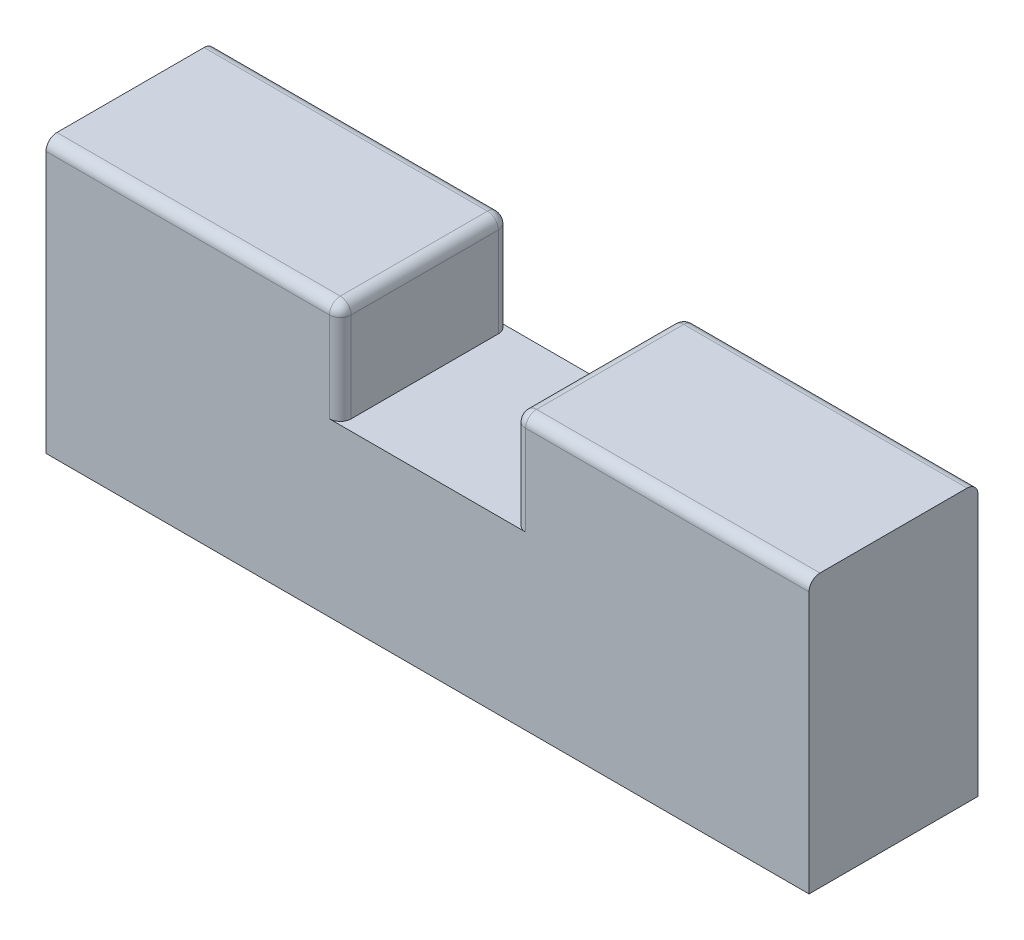
ISO-10303-21;
HEADER;
FILE_DESCRIPTION(('STEP AP214'),'2;1');
FILE_NAME('part.step','',(''),(''),'','','');
FILE_SCHEMA(('AUTOMOTIVE_DESIGN { 1 0 10303 214 1 1 1 1 }'));
ENDSEC;
DATA;
#1=APPLICATION_CONTEXT('core data for automotive mechanical design processes');
#2=APPLICATION_PROTOCOL_DEFINITION('international standard','automotive_design',2000,#1);
#3=PRODUCT_CONTEXT('',#1,'mechanical');
#4=PRODUCT('Part','Part','',(#3));
#5=PRODUCT_RELATED_PRODUCT_CATEGORY('part','',(#4));
#6=PRODUCT_DEFINITION_FORMATION('','',#4);
#7=PRODUCT_DEFINITION_CONTEXT('part definition',#1,'design');
#8=PRODUCT_DEFINITION('design','',#6,#7);
#9=PRODUCT_DEFINITION_SHAPE('','',#8);
#10=(LENGTH_UNIT() NAMED_UNIT(*) SI_UNIT(.MILLI.,.METRE.));
#11=(NAMED_UNIT(*) PLANE_ANGLE_UNIT() SI_UNIT($,.RADIAN.));
#12=(NAMED_UNIT(*) SI_UNIT($,.STERADIAN.) SOLID_ANGLE_UNIT());
#13=UNCERTAINTY_MEASURE_WITH_UNIT(LENGTH_MEASURE(1.E-05),#10,'distance_accuracy_value','');
#14=(GEOMETRIC_REPRESENTATION_CONTEXT(3) GLOBAL_UNCERTAINTY_ASSIGNED_CONTEXT((#13)) GLOBAL_UNIT_ASSIGNED_CONTEXT((#10,
#11,#12)) REPRESENTATION_CONTEXT('',''));
#15=CARTESIAN_POINT('',(0.,0.,0.));
#16=DIRECTION('',(0.,0.,1.));
#17=DIRECTION('',(1.,0.,0.));
#18=AXIS2_PLACEMENT_3D('',#15,#16,#17);
#19=CARTESIAN_POINT('',(35.,12.5,7.75));
#20=DIRECTION('',(0.,-1.,0.));
#21=DIRECTION('',(0.,0.,-1.));
#22=AXIS2_PLACEMENT_3D('',#19,#20,#21);
#23=PLANE('',#22);
#24=DIRECTION('',(0.,0.,1.));
#25=VECTOR('',#24,1.);
#26=CARTESIAN_POINT('',(9.,12.5,7.75));
#27=LINE('',#26,#25);
#28=CARTESIAN_POINT('',(9.,12.5,-6.75));
#29=VERTEX_POINT('',#28);
#30=CARTESIAN_POINT('',(9.,12.5,6.75));
#31=VERTEX_POINT('',#30);
#32=EDGE_CURVE('E189',#29,#31,#27,.T.);
#33=ORIENTED_EDGE('',*,*,#32,.T.);
#34=DIRECTION('',(-1.,0.,0.));
#35=VECTOR('',#34,1.);
#36=CARTESIAN_POINT('',(35.,12.5,6.75));
#37=LINE('',#36,#35);
#38=CARTESIAN_POINT('',(35.,12.5,6.75));
#39=VERTEX_POINT('',#38);
#40=EDGE_CURVE('E285',#31,#39,#37,.F.);
#41=ORIENTED_EDGE('',*,*,#40,.T.);
#42=DIRECTION('',(0.,0.,1.));
#43=VECTOR('',#42,1.);
#44=CARTESIAN_POINT('',(35.,12.5,7.75));
#45=LINE('',#44,#43);
#46=CARTESIAN_POINT('',(35.,12.5,-6.75));
#47=VERTEX_POINT('',#46);
#48=EDGE_CURVE('E179',#47,#39,#45,.T.);
#49=ORIENTED_EDGE('',*,*,#48,.F.);
#50=DIRECTION('',(-1.,0.,0.));
#51=VECTOR('',#50,1.);
#52=CARTESIAN_POINT('',(35.,12.5,-6.75));
#53=LINE('',#52,#51);
#54=EDGE_CURVE('E282',#47,#29,#53,.T.);
#55=ORIENTED_EDGE('',*,*,#54,.T.);
#56=EDGE_LOOP('',(#33,#41,#49,#55));
#57=FACE_BOUND('',#56,.T.);
#58=ADVANCED_FACE('F49',(#57),#23,.F.);
#59=CARTESIAN_POINT('',(35.,-12.5,-7.75));
#60=DIRECTION('',(0.,0.,1.));
#61=DIRECTION('',(1.,0.,0.));
#62=AXIS2_PLACEMENT_3D('',#59,#60,#61);
#63=PLANE('',#62);
#64=DIRECTION('',(1.,0.,0.));
#65=VECTOR('',#64,1.);
#66=CARTESIAN_POINT('',(-8.,3.25000000000001,-7.75));
#67=LINE('',#66,#65);
#68=CARTESIAN_POINT('',(-9.00000000000001,3.25000000000001,-7.75));
#69=VERTEX_POINT('',#68);
#70=CARTESIAN_POINT('',(9.,3.25000000000001,-7.75));
#71=VERTEX_POINT('',#70);
#72=EDGE_CURVE('E362',#69,#71,#67,.T.);
#73=ORIENTED_EDGE('',*,*,#72,.T.);
#74=DIRECTION('',(0.,1.,0.));
#75=VECTOR('',#74,1.);
#76=CARTESIAN_POINT('',(9.,-12.5,-7.75));
#77=LINE('',#76,#75);
#78=CARTESIAN_POINT('',(9.,11.5,-7.75));
#79=VERTEX_POINT('',#78);
#80=EDGE_CURVE('E266',#71,#79,#77,.T.);
#81=ORIENTED_EDGE('',*,*,#80,.T.);
#82=DIRECTION('',(-1.,0.,0.));
#83=VECTOR('',#82,1.);
#84=CARTESIAN_POINT('',(35.,11.5,-7.75));
#85=LINE('',#84,#83);
#86=CARTESIAN_POINT('',(35.,11.5,-7.75));
#87=VERTEX_POINT('',#86);
#88=EDGE_CURVE('E263',#79,#87,#85,.F.);
#89=ORIENTED_EDGE('',*,*,#88,.T.);
#90=DIRECTION('',(0.,1.,0.));
#91=VECTOR('',#90,1.);
#92=CARTESIAN_POINT('',(35.,-12.5,-7.75));
#93=LINE('',#92,#91);
#94=CARTESIAN_POINT('',(35.,-12.5,-7.75));
#95=VERTEX_POINT('',#94);
#96=EDGE_CURVE('E214',#95,#87,#93,.T.);
#97=ORIENTED_EDGE('',*,*,#96,.F.);
#98=DIRECTION('',(-1.,0.,0.));
#99=VECTOR('',#98,1.);
#100=CARTESIAN_POINT('',(35.,-12.5,-7.75));
#101=LINE('',#100,#99);
#102=CARTESIAN_POINT('',(-35.,-12.5,-7.75));
#103=VERTEX_POINT('',#102);
#104=EDGE_CURVE('E190',#95,#103,#101,.T.);
#105=ORIENTED_EDGE('',*,*,#104,.T.);
#106=DIRECTION('',(0.,1.,0.));
#107=VECTOR('',#106,1.);
#108=CARTESIAN_POINT('',(-35.,-12.5,-7.75));
#109=LINE('',#108,#107);
#110=CARTESIAN_POINT('',(-35.,11.5,-7.75));
#111=VERTEX_POINT('',#110);
#112=EDGE_CURVE('E202',#103,#111,#109,.T.);
#113=ORIENTED_EDGE('',*,*,#112,.T.);
#114=DIRECTION('',(-1.,0.,0.));
#115=VECTOR('',#114,1.);
#116=CARTESIAN_POINT('',(35.,11.5,-7.75));
#117=LINE('',#116,#115);
#118=CARTESIAN_POINT('',(-9.00000000000001,11.5,-7.75));
#119=VERTEX_POINT('',#118);
#120=EDGE_CURVE('E256',#111,#119,#117,.F.);
#121=ORIENTED_EDGE('',*,*,#120,.T.);
#122=DIRECTION('',(0.,-1.,0.));
#123=VECTOR('',#122,1.);
#124=CARTESIAN_POINT('',(-9.00000000000001,-12.5,-7.75));
#125=LINE('',#124,#123);
#126=EDGE_CURVE('E259',#119,#69,#125,.T.);
#127=ORIENTED_EDGE('',*,*,#126,.T.);
#128=EDGE_LOOP('',(#73,#81,#89,#97,#105,#113,#121,#127));
#129=FACE_BOUND('',#128,.T.);
#130=ADVANCED_FACE('F407',(#129),#63,.F.);
#131=DIRECTION('',(0.,0.,-1.));
#132=VECTOR('',#131,1.);
#133=CARTESIAN_POINT('',(-9.00000000000001,12.5,7.75));
#134=LINE('',#133,#132);
#135=CARTESIAN_POINT('',(-9.00000000000001,12.5,6.75));
#136=VERTEX_POINT('',#135);
#137=CARTESIAN_POINT('',(-9.00000000000001,12.5,-6.75));
#138=VERTEX_POINT('',#137);
#139=EDGE_CURVE('E223',#136,#138,#134,.T.);
#140=ORIENTED_EDGE('',*,*,#139,.T.);
#141=DIRECTION('',(-1.,0.,0.));
#142=VECTOR('',#141,1.);
#143=CARTESIAN_POINT('',(35.,12.5,-6.75));
#144=LINE('',#143,#142);
#145=CARTESIAN_POINT('',(-35.,12.5,-6.75));
#146=VERTEX_POINT('',#145);
#147=EDGE_CURVE('E74',#138,#146,#144,.T.);
#148=ORIENTED_EDGE('',*,*,#147,.T.);
#149=DIRECTION('',(0.,0.,1.));
#150=VECTOR('',#149,1.);
#151=CARTESIAN_POINT('',(-35.,12.5,7.75));
#152=LINE('',#151,#150);
#153=CARTESIAN_POINT('',(-35.,12.5,6.75));
#154=VERTEX_POINT('',#153);
#155=EDGE_CURVE('E206',#146,#154,#152,.T.);
#156=ORIENTED_EDGE('',*,*,#155,.T.);
#157=DIRECTION('',(-1.,0.,0.));
#158=VECTOR('',#157,1.);
#159=CARTESIAN_POINT('',(35.,12.5,6.75));
#160=LINE('',#159,#158);
#161=EDGE_CURVE('E293',#154,#136,#160,.F.);
#162=ORIENTED_EDGE('',*,*,#161,.T.);
#163=EDGE_LOOP('',(#140,#148,#156,#162));
#164=FACE_BOUND('',#163,.T.);
#165=ADVANCED_FACE('F427',(#164),#23,.F.);
#166=CARTESIAN_POINT('',(35.,-12.5,7.75));
#167=DIRECTION('',(0.,0.,-1.));
#168=DIRECTION('',(-1.,0.,0.));
#169=AXIS2_PLACEMENT_3D('',#166,#167,#168);
#170=PLANE('',#169);
#171=DIRECTION('',(0.,1.,0.));
#172=VECTOR('',#171,1.);
#173=CARTESIAN_POINT('',(9.,-12.5,7.75));
#174=LINE('',#173,#172);
#175=CARTESIAN_POINT('',(9.,11.5,7.75));
#176=VERTEX_POINT('',#175);
#177=CARTESIAN_POINT('',(9.,3.25000000000001,7.75));
#178=VERTEX_POINT('',#177);
#179=EDGE_CURVE('E247',#176,#178,#174,.F.);
#180=ORIENTED_EDGE('',*,*,#179,.T.);
#181=DIRECTION('',(1.,0.,0.));
#182=VECTOR('',#181,1.);
#183=CARTESIAN_POINT('',(-8.,3.25000000000001,7.75));
#184=LINE('',#183,#182);
#185=CARTESIAN_POINT('',(-9.00000000000001,3.25000000000001,7.75));
#186=VERTEX_POINT('',#185);
#187=EDGE_CURVE('E320',#186,#178,#184,.T.);
#188=ORIENTED_EDGE('',*,*,#187,.F.);
#189=DIRECTION('',(0.,1.,0.));
#190=VECTOR('',#189,1.);
#191=CARTESIAN_POINT('',(-9.00000000000001,-12.5,7.75));
#192=LINE('',#191,#190);
#193=CARTESIAN_POINT('',(-9.00000000000001,11.5,7.75));
#194=VERTEX_POINT('',#193);
#195=EDGE_CURVE('E240',#186,#194,#192,.T.);
#196=ORIENTED_EDGE('',*,*,#195,.T.);
#197=DIRECTION('',(-1.,0.,0.));
#198=VECTOR('',#197,1.);
#199=CARTESIAN_POINT('',(35.,11.5,7.75));
#200=LINE('',#199,#198);
#201=CARTESIAN_POINT('',(-35.,11.5,7.75));
#202=VERTEX_POINT('',#201);
#203=EDGE_CURVE('E237',#194,#202,#200,.T.);
#204=ORIENTED_EDGE('',*,*,#203,.T.);
#205=DIRECTION('',(0.,-1.,0.));
#206=VECTOR('',#205,1.);
#207=CARTESIAN_POINT('',(-35.,-12.5,7.75));
#208=LINE('',#207,#206);
#209=CARTESIAN_POINT('',(-35.,-12.5,7.75));
#210=VERTEX_POINT('',#209);
#211=EDGE_CURVE('E185',#202,#210,#208,.T.);
#212=ORIENTED_EDGE('',*,*,#211,.T.);
#213=DIRECTION('',(-1.,0.,0.));
#214=VECTOR('',#213,1.);
#215=CARTESIAN_POINT('',(35.,-12.5,7.75));
#216=LINE('',#215,#214);
#217=CARTESIAN_POINT('',(35.,-12.5,7.75));
#218=VERTEX_POINT('',#217);
#219=EDGE_CURVE('E182',#218,#210,#216,.T.);
#220=ORIENTED_EDGE('',*,*,#219,.F.);
#221=DIRECTION('',(0.,-1.,0.));
#222=VECTOR('',#221,1.);
#223=CARTESIAN_POINT('',(35.,-12.5,7.75));
#224=LINE('',#223,#222);
#225=CARTESIAN_POINT('',(35.,11.5,7.75));
#226=VERTEX_POINT('',#225);
#227=EDGE_CURVE('E166',#226,#218,#224,.T.);
#228=ORIENTED_EDGE('',*,*,#227,.F.);
#229=DIRECTION('',(-1.,0.,0.));
#230=VECTOR('',#229,1.);
#231=CARTESIAN_POINT('',(35.,11.5,7.75));
#232=LINE('',#231,#230);
#233=EDGE_CURVE('E244',#226,#176,#232,.T.);
#234=ORIENTED_EDGE('',*,*,#233,.T.);
#235=EDGE_LOOP('',(#180,#188,#196,#204,#212,#220,#228,#234));
#236=FACE_BOUND('',#235,.T.);
#237=ADVANCED_FACE('F184',(#236),#170,.F.);
#238=CARTESIAN_POINT('',(35.,-12.5,7.75));
#239=DIRECTION('',(0.,1.,0.));
#240=DIRECTION('',(0.,0.,1.));
#241=AXIS2_PLACEMENT_3D('',#238,#239,#240);
#242=PLANE('',#241);
#243=DIRECTION('',(0.,0.,-1.));
#244=VECTOR('',#243,1.);
#245=CARTESIAN_POINT('',(-35.,-12.5,7.75));
#246=LINE('',#245,#244);
#247=EDGE_CURVE('E212',#210,#103,#246,.T.);
#248=ORIENTED_EDGE('',*,*,#247,.T.);
#249=ORIENTED_EDGE('',*,*,#104,.F.);
#250=DIRECTION('',(0.,0.,-1.));
#251=VECTOR('',#250,1.);
#252=CARTESIAN_POINT('',(35.,-12.5,7.75));
#253=LINE('',#252,#251);
#254=EDGE_CURVE('E172',#218,#95,#253,.T.);
#255=ORIENTED_EDGE('',*,*,#254,.F.);
#256=ORIENTED_EDGE('',*,*,#219,.T.);
#257=EDGE_LOOP('',(#248,#249,#255,#256));
#258=FACE_BOUND('',#257,.T.);
#259=ADVANCED_FACE('F192',(#258),#242,.F.);
#260=CARTESIAN_POINT('',(35.,0.,0.));
#261=DIRECTION('',(-1.,0.,0.));
#262=DIRECTION('',(0.,0.,1.));
#263=AXIS2_PLACEMENT_3D('',#260,#261,#262);
#264=PLANE('',#263);
#265=ORIENTED_EDGE('',*,*,#48,.T.);
#266=CARTESIAN_POINT('',(35.,11.5,6.75));
#267=DIRECTION('',(-1.,0.,0.));
#268=DIRECTION('',(0.,0.,1.));
#269=AXIS2_PLACEMENT_3D('',#266,#267,#268);
#270=CIRCLE('',#269,1.);
#271=EDGE_CURVE('E175',#39,#226,#270,.F.);
#272=ORIENTED_EDGE('',*,*,#271,.T.);
#273=ORIENTED_EDGE('',*,*,#227,.T.);
#274=ORIENTED_EDGE('',*,*,#254,.T.);
#275=ORIENTED_EDGE('',*,*,#96,.T.);
#276=CARTESIAN_POINT('',(35.,11.5,-6.75));
#277=DIRECTION('',(-1.,0.,0.));
#278=DIRECTION('',(0.,0.,1.));
#279=AXIS2_PLACEMENT_3D('',#276,#277,#278);
#280=CIRCLE('',#279,1.);
#281=EDGE_CURVE('E288',#87,#47,#280,.F.);
#282=ORIENTED_EDGE('',*,*,#281,.T.);
#283=EDGE_LOOP('',(#265,#272,#273,#274,#275,#282));
#284=FACE_BOUND('',#283,.T.);
#285=ADVANCED_FACE('F169',(#284),#264,.F.);
#286=CARTESIAN_POINT('',(-35.,0.,0.));
#287=DIRECTION('',(-1.,0.,0.));
#288=DIRECTION('',(0.,0.,1.));
#289=AXIS2_PLACEMENT_3D('',#286,#287,#288);
#290=PLANE('',#289);
#291=ORIENTED_EDGE('',*,*,#155,.F.);
#292=CARTESIAN_POINT('',(-35.,11.5,-6.75));
#293=DIRECTION('',(-1.,0.,0.));
#294=DIRECTION('',(0.,0.,1.));
#295=AXIS2_PLACEMENT_3D('',#292,#293,#294);
#296=CIRCLE('',#295,1.);
#297=EDGE_CURVE('E300',#146,#111,#296,.T.);
#298=ORIENTED_EDGE('',*,*,#297,.T.);
#299=ORIENTED_EDGE('',*,*,#112,.F.);
#300=ORIENTED_EDGE('',*,*,#247,.F.);
#301=ORIENTED_EDGE('',*,*,#211,.F.);
#302=CARTESIAN_POINT('',(-35.,11.5,6.75));
#303=DIRECTION('',(-1.,0.,0.));
#304=DIRECTION('',(0.,0.,1.));
#305=AXIS2_PLACEMENT_3D('',#302,#303,#304);
#306=CIRCLE('',#305,1.);
#307=EDGE_CURVE('E67',#202,#154,#306,.T.);
#308=ORIENTED_EDGE('',*,*,#307,.T.);
#309=EDGE_LOOP('',(#291,#298,#299,#300,#301,#308));
#310=FACE_BOUND('',#309,.T.);
#311=ADVANCED_FACE('F426',(#310),#290,.T.);
#312=CARTESIAN_POINT('',(7.99999999999999,21.75,-7.75));
#313=DIRECTION('',(1.,0.,0.));
#314=DIRECTION('',(0.,1.,0.));
#315=AXIS2_PLACEMENT_3D('',#312,#313,#314);
#316=PLANE('',#315);
#317=DIRECTION('',(0.,0.,1.));
#318=VECTOR('',#317,1.);
#319=CARTESIAN_POINT('',(8.,3.25000000000001,-7.75));
#320=LINE('',#319,#318);
#321=CARTESIAN_POINT('',(8.,3.25000000000001,-6.75));
#322=VERTEX_POINT('',#321);
#323=CARTESIAN_POINT('',(8.,3.25000000000001,6.75));
#324=VERTEX_POINT('',#323);
#325=EDGE_CURVE('E207',#322,#324,#320,.T.);
#326=ORIENTED_EDGE('',*,*,#325,.T.);
#327=DIRECTION('',(0.,1.,0.));
#328=VECTOR('',#327,1.);
#329=CARTESIAN_POINT('',(7.99999999999999,21.75,6.75));
#330=LINE('',#329,#328);
#331=CARTESIAN_POINT('',(7.99999999999999,11.5,6.75));
#332=VERTEX_POINT('',#331);
#333=EDGE_CURVE('E233',#324,#332,#330,.T.);
#334=ORIENTED_EDGE('',*,*,#333,.T.);
#335=DIRECTION('',(0.,0.,1.));
#336=VECTOR('',#335,1.);
#337=CARTESIAN_POINT('',(7.99999999999999,11.5,-7.75));
#338=LINE('',#337,#336);
#339=CARTESIAN_POINT('',(7.99999999999999,11.5,-6.75));
#340=VERTEX_POINT('',#339);
#341=EDGE_CURVE('E219',#332,#340,#338,.F.);
#342=ORIENTED_EDGE('',*,*,#341,.T.);
#343=DIRECTION('',(0.,1.,0.));
#344=VECTOR('',#343,1.);
#345=CARTESIAN_POINT('',(7.99999999999999,21.75,-6.75));
#346=LINE('',#345,#344);
#347=EDGE_CURVE('E230',#340,#322,#346,.F.);
#348=ORIENTED_EDGE('',*,*,#347,.T.);
#349=EDGE_LOOP('',(#326,#334,#342,#348));
#350=FACE_BOUND('',#349,.T.);
#351=ADVANCED_FACE('F392',(#350),#316,.F.);
#352=CARTESIAN_POINT('',(-8.,21.75,-7.75));
#353=DIRECTION('',(-1.,0.,0.));
#354=DIRECTION('',(0.,0.,1.));
#355=AXIS2_PLACEMENT_3D('',#352,#353,#354);
#356=PLANE('',#355);
#357=DIRECTION('',(0.,0.,1.));
#358=VECTOR('',#357,1.);
#359=CARTESIAN_POINT('',(-8.,3.25000000000001,-7.75));
#360=LINE('',#359,#358);
#361=CARTESIAN_POINT('',(-8.,3.25000000000001,-6.75));
#362=VERTEX_POINT('',#361);
#363=CARTESIAN_POINT('',(-8.,3.25000000000001,6.75));
#364=VERTEX_POINT('',#363);
#365=EDGE_CURVE('E357',#362,#364,#360,.T.);
#366=ORIENTED_EDGE('',*,*,#365,.F.);
#367=DIRECTION('',(0.,-1.,0.));
#368=VECTOR('',#367,1.);
#369=CARTESIAN_POINT('',(-8.,21.75,-6.75));
#370=LINE('',#369,#368);
#371=CARTESIAN_POINT('',(-8.,11.5,-6.75));
#372=VERTEX_POINT('',#371);
#373=EDGE_CURVE('E273',#362,#372,#370,.F.);
#374=ORIENTED_EDGE('',*,*,#373,.T.);
#375=DIRECTION('',(0.,0.,-1.));
#376=VECTOR('',#375,1.);
#377=CARTESIAN_POINT('',(-8.,11.5,-7.75));
#378=LINE('',#377,#376);
#379=CARTESIAN_POINT('',(-8.,11.5,6.75));
#380=VERTEX_POINT('',#379);
#381=EDGE_CURVE('E226',#372,#380,#378,.F.);
#382=ORIENTED_EDGE('',*,*,#381,.T.);
#383=DIRECTION('',(0.,1.,0.));
#384=VECTOR('',#383,1.);
#385=CARTESIAN_POINT('',(-8.,21.75,6.75));
#386=LINE('',#385,#384);
#387=EDGE_CURVE('E270',#380,#364,#386,.F.);
#388=ORIENTED_EDGE('',*,*,#387,.T.);
#389=EDGE_LOOP('',(#366,#374,#382,#388));
#390=FACE_BOUND('',#389,.T.);
#391=ADVANCED_FACE('F413',(#390),#356,.F.);
#392=CARTESIAN_POINT('',(-8.,3.25000000000001,-7.75));
#393=DIRECTION('',(0.,-1.,0.));
#394=DIRECTION('',(0.,0.,-1.));
#395=AXIS2_PLACEMENT_3D('',#392,#393,#394);
#396=PLANE('',#395);
#397=ORIENTED_EDGE('',*,*,#187,.T.);
#398=CARTESIAN_POINT('',(9.,3.25000000000001,6.75));
#399=DIRECTION('',(0.,-1.,0.));
#400=DIRECTION('',(0.,0.,-1.));
#401=AXIS2_PLACEMENT_3D('',#398,#399,#400);
#402=CIRCLE('',#401,1.);
#403=EDGE_CURVE('E303',#178,#324,#402,.T.);
#404=ORIENTED_EDGE('',*,*,#403,.T.);
#405=ORIENTED_EDGE('',*,*,#325,.F.);
#406=CARTESIAN_POINT('',(9.,3.25000000000001,-6.75));
#407=DIRECTION('',(0.,-1.,0.));
#408=DIRECTION('',(0.,0.,-1.));
#409=AXIS2_PLACEMENT_3D('',#406,#407,#408);
#410=CIRCLE('',#409,1.);
#411=EDGE_CURVE('E306',#322,#71,#410,.T.);
#412=ORIENTED_EDGE('',*,*,#411,.T.);
#413=ORIENTED_EDGE('',*,*,#72,.F.);
#414=CARTESIAN_POINT('',(-9.00000000000001,3.25000000000001,-6.75));
#415=DIRECTION('',(0.,-1.,0.));
#416=DIRECTION('',(0.,0.,-1.));
#417=AXIS2_PLACEMENT_3D('',#414,#415,#416);
#418=CIRCLE('',#417,1.);
#419=EDGE_CURVE('E59',#69,#362,#418,.T.);
#420=ORIENTED_EDGE('',*,*,#419,.T.);
#421=ORIENTED_EDGE('',*,*,#365,.T.);
#422=CARTESIAN_POINT('',(-9.00000000000001,3.25000000000001,6.75));
#423=DIRECTION('',(0.,-1.,0.));
#424=DIRECTION('',(0.,0.,-1.));
#425=AXIS2_PLACEMENT_3D('',#422,#423,#424);
#426=CIRCLE('',#425,1.);
#427=EDGE_CURVE('E11',#364,#186,#426,.T.);
#428=ORIENTED_EDGE('',*,*,#427,.T.);
#429=EDGE_LOOP('',(#397,#404,#405,#412,#413,#420,#421,#428));
#430=FACE_BOUND('',#429,.T.);
#431=ADVANCED_FACE('F355',(#430),#396,.F.);
#432=CARTESIAN_POINT('',(9.,11.5,7.75));
#433=DIRECTION('',(0.,0.,1.));
#434=DIRECTION('',(1.,0.,0.));
#435=AXIS2_PLACEMENT_3D('',#432,#433,#434);
#436=CYLINDRICAL_SURFACE('',#435,1.);
#437=ORIENTED_EDGE('',*,*,#341,.F.);
#438=CARTESIAN_POINT('',(9.,11.5,6.75));
#439=DIRECTION('',(0.,0.,1.));
#440=DIRECTION('',(1.,0.,0.));
#441=AXIS2_PLACEMENT_3D('',#438,#439,#440);
#442=CIRCLE('',#441,1.);
#443=EDGE_CURVE('E253',#332,#31,#442,.F.);
#444=ORIENTED_EDGE('',*,*,#443,.T.);
#445=ORIENTED_EDGE('',*,*,#32,.F.);
#446=CARTESIAN_POINT('',(9.,11.5,-6.75));
#447=DIRECTION('',(0.,0.,1.));
#448=DIRECTION('',(1.,0.,0.));
#449=AXIS2_PLACEMENT_3D('',#446,#447,#448);
#450=CIRCLE('',#449,1.);
#451=EDGE_CURVE('E250',#29,#340,#450,.T.);
#452=ORIENTED_EDGE('',*,*,#451,.T.);
#453=EDGE_LOOP('',(#437,#444,#445,#452));
#454=FACE_BOUND('',#453,.T.);
#455=ADVANCED_FACE('F442',(#454),#436,.T.);
#456=CARTESIAN_POINT('',(-9.00000000000001,11.5,7.75));
#457=DIRECTION('',(0.,0.,-1.));
#458=DIRECTION('',(-1.,0.,0.));
#459=AXIS2_PLACEMENT_3D('',#456,#457,#458);
#460=CYLINDRICAL_SURFACE('',#459,1.);
#461=ORIENTED_EDGE('',*,*,#381,.F.);
#462=CARTESIAN_POINT('',(-9.00000000000001,11.5,-6.75));
#463=DIRECTION('',(0.,0.,-1.));
#464=DIRECTION('',(-1.,0.,0.));
#465=AXIS2_PLACEMENT_3D('',#462,#463,#464);
#466=CIRCLE('',#465,1.);
#467=EDGE_CURVE('E279',#372,#138,#466,.F.);
#468=ORIENTED_EDGE('',*,*,#467,.T.);
#469=ORIENTED_EDGE('',*,*,#139,.F.);
#470=CARTESIAN_POINT('',(-9.00000000000001,11.5,6.75));
#471=DIRECTION('',(0.,0.,-1.));
#472=DIRECTION('',(-1.,0.,0.));
#473=AXIS2_PLACEMENT_3D('',#470,#471,#472);
#474=CIRCLE('',#473,1.);
#475=EDGE_CURVE('E276',#136,#380,#474,.T.);
#476=ORIENTED_EDGE('',*,*,#475,.T.);
#477=EDGE_LOOP('',(#461,#468,#469,#476));
#478=FACE_BOUND('',#477,.T.);
#479=ADVANCED_FACE('F416',(#478),#460,.T.);
#480=CARTESIAN_POINT('',(35.,11.5,6.75));
#481=DIRECTION('',(-1.,0.,0.));
#482=DIRECTION('',(0.,0.,1.));
#483=AXIS2_PLACEMENT_3D('',#480,#481,#482);
#484=CYLINDRICAL_SURFACE('',#483,1.);
#485=ORIENTED_EDGE('',*,*,#271,.F.);
#486=ORIENTED_EDGE('',*,*,#40,.F.);
#487=CARTESIAN_POINT('',(9.,11.5,6.75));
#488=DIRECTION('',(-1.,0.,0.));
#489=DIRECTION('',(0.,0.,1.));
#490=AXIS2_PLACEMENT_3D('',#487,#488,#489);
#491=CIRCLE('',#490,1.);
#492=EDGE_CURVE('E315',#176,#31,#491,.T.);
#493=ORIENTED_EDGE('',*,*,#492,.F.);
#494=ORIENTED_EDGE('',*,*,#233,.F.);
#495=EDGE_LOOP('',(#485,#486,#493,#494));
#496=FACE_BOUND('',#495,.T.);
#497=ADVANCED_FACE('F381',(#496),#484,.T.);
#498=CARTESIAN_POINT('',(9.,11.5,6.75));
#499=DIRECTION('',(0.,0.,-1.));
#500=DIRECTION('',(-1.,0.,0.));
#501=AXIS2_PLACEMENT_3D('',#498,#499,#500);
#502=SPHERICAL_SURFACE('',#501,1.);
#503=ORIENTED_EDGE('',*,*,#492,.T.);
#504=ORIENTED_EDGE('',*,*,#443,.F.);
#505=CARTESIAN_POINT('',(9.,11.5,6.75));
#506=DIRECTION('',(0.,-1.,0.));
#507=DIRECTION('',(0.,0.,-1.));
#508=AXIS2_PLACEMENT_3D('',#505,#506,#507);
#509=CIRCLE('',#508,1.);
#510=EDGE_CURVE('E312',#176,#332,#509,.T.);
#511=ORIENTED_EDGE('',*,*,#510,.F.);
#512=EDGE_LOOP('',(#503,#504,#511));
#513=FACE_BOUND('',#512,.T.);
#514=ADVANCED_FACE('F445',(#513),#502,.T.);
#515=CARTESIAN_POINT('',(8.99999999999999,21.75,6.75));
#516=DIRECTION('',(0.,1.,0.));
#517=DIRECTION('',(-1.,0.,0.));
#518=AXIS2_PLACEMENT_3D('',#515,#516,#517);
#519=CYLINDRICAL_SURFACE('',#518,1.);
#520=ORIENTED_EDGE('',*,*,#403,.F.);
#521=ORIENTED_EDGE('',*,*,#179,.F.);
#522=ORIENTED_EDGE('',*,*,#510,.T.);
#523=ORIENTED_EDGE('',*,*,#333,.F.);
#524=EDGE_LOOP('',(#520,#521,#522,#523));
#525=FACE_BOUND('',#524,.T.);
#526=ADVANCED_FACE('F388',(#525),#519,.T.);
#527=CARTESIAN_POINT('',(35.,11.5,-6.75));
#528=DIRECTION('',(-1.,0.,0.));
#529=DIRECTION('',(0.,0.,1.));
#530=AXIS2_PLACEMENT_3D('',#527,#528,#529);
#531=CYLINDRICAL_SURFACE('',#530,1.);
#532=CARTESIAN_POINT('',(9.,11.5,-6.75));
#533=DIRECTION('',(-1.,0.,0.));
#534=DIRECTION('',(0.,0.,1.));
#535=AXIS2_PLACEMENT_3D('',#532,#533,#534);
#536=CIRCLE('',#535,1.);
#537=EDGE_CURVE('E316',#29,#79,#536,.T.);
#538=ORIENTED_EDGE('',*,*,#537,.F.);
#539=ORIENTED_EDGE('',*,*,#54,.F.);
#540=ORIENTED_EDGE('',*,*,#281,.F.);
#541=ORIENTED_EDGE('',*,*,#88,.F.);
#542=EDGE_LOOP('',(#538,#539,#540,#541));
#543=FACE_BOUND('',#542,.T.);
#544=ADVANCED_FACE('F405',(#543),#531,.T.);
#545=CARTESIAN_POINT('',(9.,11.5,-6.75));
#546=DIRECTION('',(0.,0.,1.));
#547=DIRECTION('',(1.,0.,0.));
#548=AXIS2_PLACEMENT_3D('',#545,#546,#547);
#549=SPHERICAL_SURFACE('',#548,1.);
#550=ORIENTED_EDGE('',*,*,#451,.F.);
#551=ORIENTED_EDGE('',*,*,#537,.T.);
#552=CARTESIAN_POINT('',(9.,11.5,-6.75));
#553=DIRECTION('',(0.,-1.,0.));
#554=DIRECTION('',(0.,0.,-1.));
#555=AXIS2_PLACEMENT_3D('',#552,#553,#554);
#556=CIRCLE('',#555,1.);
#557=EDGE_CURVE('E321',#340,#79,#556,.T.);
#558=ORIENTED_EDGE('',*,*,#557,.F.);
#559=EDGE_LOOP('',(#550,#551,#558));
#560=FACE_BOUND('',#559,.T.);
#561=ADVANCED_FACE('F401',(#560),#549,.T.);
#562=CARTESIAN_POINT('',(9.,-12.5,-6.75));
#563=DIRECTION('',(0.,1.,0.));
#564=DIRECTION('',(-1.,0.,0.));
#565=AXIS2_PLACEMENT_3D('',#562,#563,#564);
#566=CYLINDRICAL_SURFACE('',#565,1.);
#567=ORIENTED_EDGE('',*,*,#411,.F.);
#568=ORIENTED_EDGE('',*,*,#347,.F.);
#569=ORIENTED_EDGE('',*,*,#557,.T.);
#570=ORIENTED_EDGE('',*,*,#80,.F.);
#571=EDGE_LOOP('',(#567,#568,#569,#570));
#572=FACE_BOUND('',#571,.T.);
#573=ADVANCED_FACE('F397',(#572),#566,.T.);
#574=CARTESIAN_POINT('',(35.,11.5,-6.75));
#575=DIRECTION('',(-1.,0.,0.));
#576=DIRECTION('',(0.,0.,1.));
#577=AXIS2_PLACEMENT_3D('',#574,#575,#576);
#578=CYLINDRICAL_SURFACE('',#577,1.);
#579=ORIENTED_EDGE('',*,*,#297,.F.);
#580=ORIENTED_EDGE('',*,*,#147,.F.);
#581=CARTESIAN_POINT('',(-9.00000000000001,11.5,-6.75));
#582=DIRECTION('',(1.,0.,0.));
#583=DIRECTION('',(0.,0.,-1.));
#584=AXIS2_PLACEMENT_3D('',#581,#582,#583);
#585=CIRCLE('',#584,1.);
#586=EDGE_CURVE('E324',#119,#138,#585,.T.);
#587=ORIENTED_EDGE('',*,*,#586,.F.);
#588=ORIENTED_EDGE('',*,*,#120,.F.);
#589=EDGE_LOOP('',(#579,#580,#587,#588));
#590=FACE_BOUND('',#589,.T.);
#591=ADVANCED_FACE('F424',(#590),#578,.T.);
#592=CARTESIAN_POINT('',(-9.00000000000001,11.5,-6.75));
#593=DIRECTION('',(0.,0.,1.));
#594=DIRECTION('',(1.,0.,0.));
#595=AXIS2_PLACEMENT_3D('',#592,#593,#594);
#596=SPHERICAL_SURFACE('',#595,1.);
#597=ORIENTED_EDGE('',*,*,#586,.T.);
#598=ORIENTED_EDGE('',*,*,#467,.F.);
#599=CARTESIAN_POINT('',(-9.00000000000001,11.5,-6.75));
#600=DIRECTION('',(0.,-1.,0.));
#601=DIRECTION('',(0.,0.,-1.));
#602=AXIS2_PLACEMENT_3D('',#599,#600,#601);
#603=CIRCLE('',#602,1.);
#604=EDGE_CURVE('E328',#119,#372,#603,.T.);
#605=ORIENTED_EDGE('',*,*,#604,.F.);
#606=EDGE_LOOP('',(#597,#598,#605));
#607=FACE_BOUND('',#606,.T.);
#608=ADVANCED_FACE('F419',(#607),#596,.T.);
#609=CARTESIAN_POINT('',(-9.00000000000001,-12.5,-6.75));
#610=DIRECTION('',(0.,-1.,0.));
#611=DIRECTION('',(0.,0.,-1.));
#612=AXIS2_PLACEMENT_3D('',#609,#610,#611);
#613=CYLINDRICAL_SURFACE('',#612,1.);
#614=ORIENTED_EDGE('',*,*,#604,.T.);
#615=ORIENTED_EDGE('',*,*,#373,.F.);
#616=ORIENTED_EDGE('',*,*,#419,.F.);
#617=ORIENTED_EDGE('',*,*,#126,.F.);
#618=EDGE_LOOP('',(#614,#615,#616,#617));
#619=FACE_BOUND('',#618,.T.);
#620=ADVANCED_FACE('F410',(#619),#613,.T.);
#621=CARTESIAN_POINT('',(35.,11.5,6.75));
#622=DIRECTION('',(-1.,0.,0.));
#623=DIRECTION('',(0.,0.,1.));
#624=AXIS2_PLACEMENT_3D('',#621,#622,#623);
#625=CYLINDRICAL_SURFACE('',#624,1.);
#626=CARTESIAN_POINT('',(-9.00000000000001,11.5,6.75));
#627=DIRECTION('',(1.,0.,0.));
#628=DIRECTION('',(0.,0.,-1.));
#629=AXIS2_PLACEMENT_3D('',#626,#627,#628);
#630=CIRCLE('',#629,1.);
#631=EDGE_CURVE('E53',#136,#194,#630,.T.);
#632=ORIENTED_EDGE('',*,*,#631,.F.);
#633=ORIENTED_EDGE('',*,*,#161,.F.);
#634=ORIENTED_EDGE('',*,*,#307,.F.);
#635=ORIENTED_EDGE('',*,*,#203,.F.);
#636=EDGE_LOOP('',(#632,#633,#634,#635));
#637=FACE_BOUND('',#636,.T.);
#638=ADVANCED_FACE('F51',(#637),#625,.T.);
#639=CARTESIAN_POINT('',(-9.00000000000001,11.5,6.75));
#640=DIRECTION('',(0.,0.,-1.));
#641=DIRECTION('',(-1.,0.,0.));
#642=AXIS2_PLACEMENT_3D('',#639,#640,#641);
#643=SPHERICAL_SURFACE('',#642,1.);
#644=ORIENTED_EDGE('',*,*,#475,.F.);
#645=ORIENTED_EDGE('',*,*,#631,.T.);
#646=CARTESIAN_POINT('',(-9.00000000000001,11.5,6.75));
#647=DIRECTION('',(0.,-1.,0.));
#648=DIRECTION('',(0.,0.,-1.));
#649=AXIS2_PLACEMENT_3D('',#646,#647,#648);
#650=CIRCLE('',#649,1.);
#651=EDGE_CURVE('E334',#380,#194,#650,.T.);
#652=ORIENTED_EDGE('',*,*,#651,.F.);
#653=EDGE_LOOP('',(#644,#645,#652));
#654=FACE_BOUND('',#653,.T.);
#655=ADVANCED_FACE('F348',(#654),#643,.T.);
#656=CARTESIAN_POINT('',(-9.00000000000001,-12.5,6.75));
#657=DIRECTION('',(0.,1.,0.));
#658=DIRECTION('',(0.,0.,1.));
#659=AXIS2_PLACEMENT_3D('',#656,#657,#658);
#660=CYLINDRICAL_SURFACE('',#659,1.);
#661=ORIENTED_EDGE('',*,*,#427,.F.);
#662=ORIENTED_EDGE('',*,*,#387,.F.);
#663=ORIENTED_EDGE('',*,*,#651,.T.);
#664=ORIENTED_EDGE('',*,*,#195,.F.);
#665=EDGE_LOOP('',(#661,#662,#663,#664));
#666=FACE_BOUND('',#665,.T.);
#667=ADVANCED_FACE('F352',(#666),#660,.T.);
#668=CLOSED_SHELL('',(#58,#130,#165,#237,#259,#285,#311,#351,#391,#431,#455,#479,#497,#514,#526,
#544,#561,#573,#591,#608,#620,#638,#655,#667));
#669=MANIFOLD_SOLID_BREP('B2',#668);
#670=ADVANCED_BREP_SHAPE_REPRESENTATION('',(#18,#669),#14);
#671=SHAPE_DEFINITION_REPRESENTATION(#9,#670);
ENDSEC;
END-ISO-10303-21;
